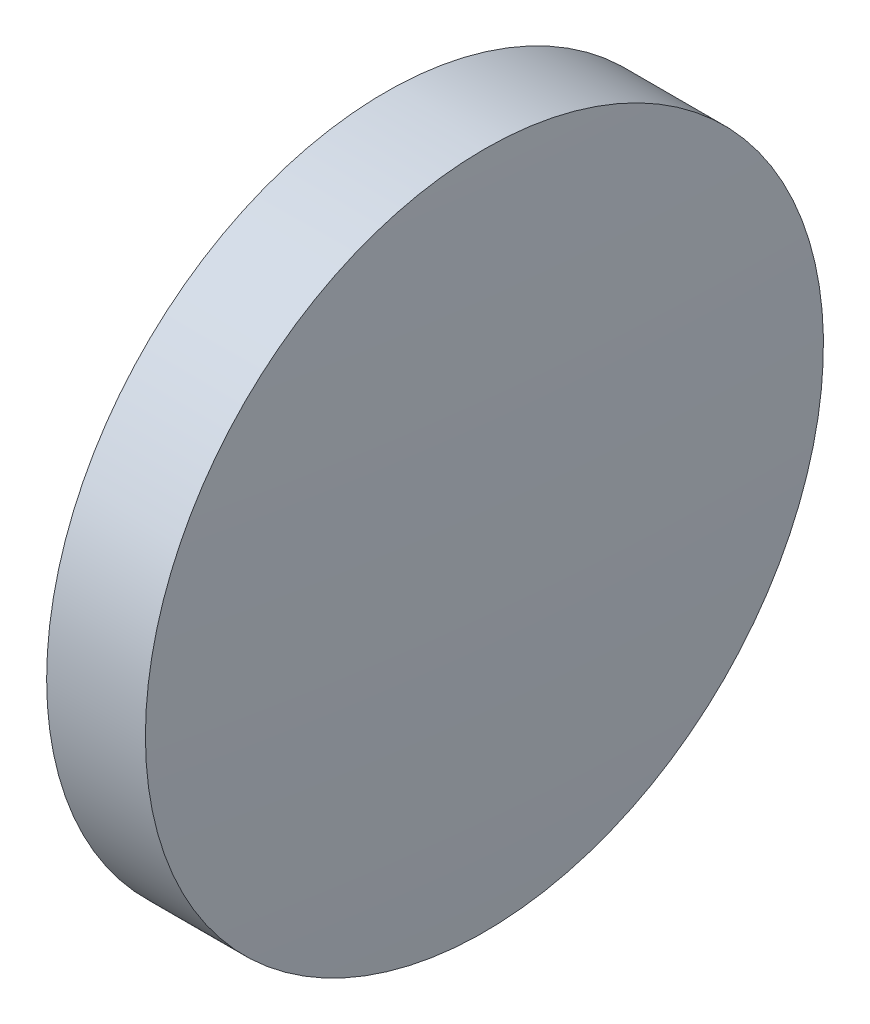
ISO-10303-21;
HEADER;
FILE_DESCRIPTION(('STEP AP214'),'2;1');
FILE_NAME('part.step','',(''),(''),'','','');
FILE_SCHEMA(('AUTOMOTIVE_DESIGN { 1 0 10303 214 1 1 1 1 }'));
ENDSEC;
DATA;
#1=APPLICATION_CONTEXT('core data for automotive mechanical design processes');
#2=APPLICATION_PROTOCOL_DEFINITION('international standard','automotive_design',2000,#1);
#3=PRODUCT_CONTEXT('',#1,'mechanical');
#4=PRODUCT('Part','Part','',(#3));
#5=PRODUCT_RELATED_PRODUCT_CATEGORY('part','',(#4));
#6=PRODUCT_DEFINITION_FORMATION('','',#4);
#7=PRODUCT_DEFINITION_CONTEXT('part definition',#1,'design');
#8=PRODUCT_DEFINITION('design','',#6,#7);
#9=PRODUCT_DEFINITION_SHAPE('','',#8);
#10=(LENGTH_UNIT() NAMED_UNIT(*) SI_UNIT(.MILLI.,.METRE.));
#11=(NAMED_UNIT(*) PLANE_ANGLE_UNIT() SI_UNIT($,.RADIAN.));
#12=(NAMED_UNIT(*) SI_UNIT($,.STERADIAN.) SOLID_ANGLE_UNIT());
#13=UNCERTAINTY_MEASURE_WITH_UNIT(LENGTH_MEASURE(1.E-05),#10,'distance_accuracy_value','');
#14=(GEOMETRIC_REPRESENTATION_CONTEXT(3) GLOBAL_UNCERTAINTY_ASSIGNED_CONTEXT((#13)) GLOBAL_UNIT_ASSIGNED_CONTEXT((#10,
#11,#12)) REPRESENTATION_CONTEXT('',''));
#15=CARTESIAN_POINT('',(0.,0.,0.));
#16=DIRECTION('',(0.,0.,1.));
#17=DIRECTION('',(1.,0.,0.));
#18=AXIS2_PLACEMENT_3D('',#15,#16,#17);
#19=CARTESIAN_POINT('',(279.428987956832,475.37417864648,0.));
#20=DIRECTION('',(-1.,0.,0.));
#21=DIRECTION('',(0.,1.,0.));
#22=AXIS2_PLACEMENT_3D('',#19,#20,#21);
#23=SPHERICAL_SURFACE('',#22,268.96666666667);
#24=CARTESIAN_POINT('',(548.095654623501,475.37417864648,0.));
#25=DIRECTION('',(-1.,0.,0.));
#26=DIRECTION('',(0.,0.,1.));
#27=AXIS2_PLACEMENT_3D('',#24,#25,#26);
#28=CIRCLE('',#27,12.7);
#29=CARTESIAN_POINT('',(548.095654623501,475.37417864648,12.7));
#30=VERTEX_POINT('',#29);
#31=EDGE_CURVE('E10',#30,#30,#28,.T.);
#32=ORIENTED_EDGE('',*,*,#31,.F.);
#33=EDGE_LOOP('',(#32));
#34=FACE_BOUND('',#33,.T.);
#35=ADVANCED_FACE('F35',(#34),#23,.T.);
#36=CARTESIAN_POINT('',(538.765758572344,475.37417864648,0.));
#37=DIRECTION('',(-1.,0.,0.));
#38=DIRECTION('',(0.,0.,1.));
#39=AXIS2_PLACEMENT_3D('',#36,#37,#38);
#40=CYLINDRICAL_SURFACE('',#39,12.7);
#41=CARTESIAN_POINT('',(544.395654623501,475.37417864648,0.));
#42=DIRECTION('',(-1.,0.,0.));
#43=DIRECTION('',(0.,0.,1.));
#44=AXIS2_PLACEMENT_3D('',#41,#42,#43);
#45=CIRCLE('',#44,12.7);
#46=CARTESIAN_POINT('',(544.395654623501,475.37417864648,12.7));
#47=VERTEX_POINT('',#46);
#48=EDGE_CURVE('E41',#47,#47,#45,.T.);
#49=ORIENTED_EDGE('',*,*,#48,.F.);
#50=EDGE_LOOP('',(#49));
#51=FACE_BOUND('',#50,.T.);
#52=ORIENTED_EDGE('',*,*,#31,.T.);
#53=EDGE_LOOP('',(#52));
#54=FACE_BOUND('',#53,.T.);
#55=ADVANCED_FACE('F49',(#51,#54),#40,.T.);
#56=CARTESIAN_POINT('',(544.395654623501,475.37417864648,0.));
#57=DIRECTION('',(1.,0.,0.));
#58=DIRECTION('',(0.,0.,-1.));
#59=AXIS2_PLACEMENT_3D('',#56,#57,#58);
#60=PLANE('',#59);
#61=ORIENTED_EDGE('',*,*,#48,.T.);
#62=EDGE_LOOP('',(#61));
#63=FACE_BOUND('',#62,.T.);
#64=ADVANCED_FACE('F47',(#63),#60,.F.);
#65=CLOSED_SHELL('',(#35,#55,#64));
#66=MANIFOLD_SOLID_BREP('B2',#65);
#67=ADVANCED_BREP_SHAPE_REPRESENTATION('',(#18,#66),#14);
#68=SHAPE_DEFINITION_REPRESENTATION(#9,#67);
ENDSEC;
END-ISO-10303-21;
